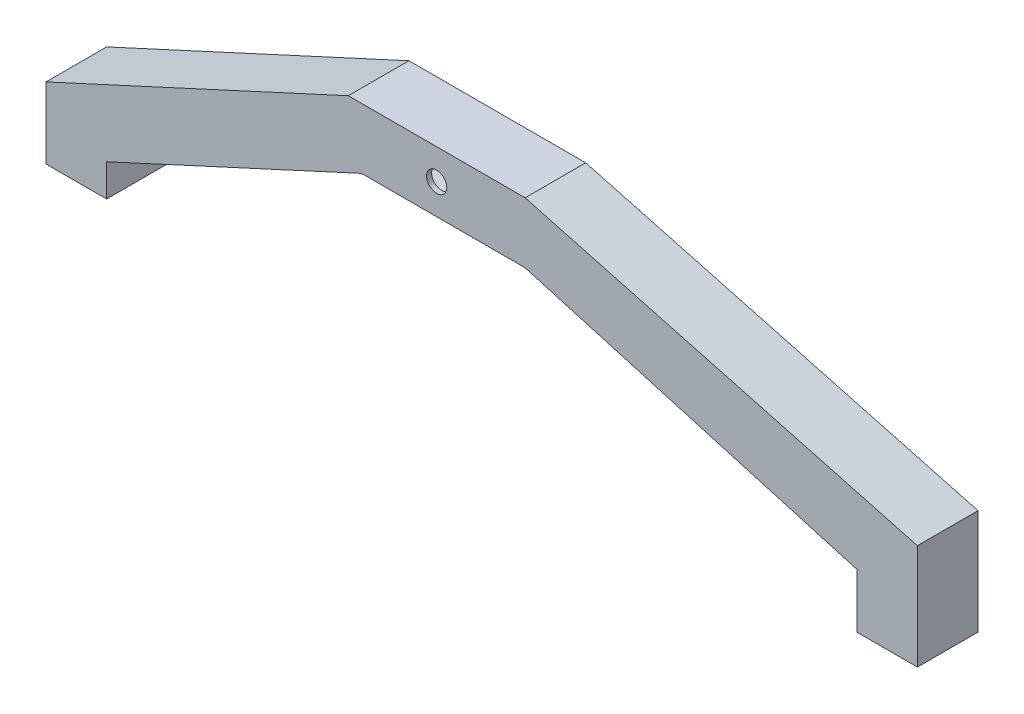
ISO-10303-21;
HEADER;
FILE_DESCRIPTION(('STEP AP214'),'2;1');
FILE_NAME('part.step','',(''),(''),'','','');
FILE_SCHEMA(('AUTOMOTIVE_DESIGN { 1 0 10303 214 1 1 1 1 }'));
ENDSEC;
DATA;
#1=APPLICATION_CONTEXT('core data for automotive mechanical design processes');
#2=APPLICATION_PROTOCOL_DEFINITION('international standard','automotive_design',2000,#1);
#3=PRODUCT_CONTEXT('',#1,'mechanical');
#4=PRODUCT('Part','Part','',(#3));
#5=PRODUCT_RELATED_PRODUCT_CATEGORY('part','',(#4));
#6=PRODUCT_DEFINITION_FORMATION('','',#4);
#7=PRODUCT_DEFINITION_CONTEXT('part definition',#1,'design');
#8=PRODUCT_DEFINITION('design','',#6,#7);
#9=PRODUCT_DEFINITION_SHAPE('','',#8);
#10=(LENGTH_UNIT() NAMED_UNIT(*) SI_UNIT(.MILLI.,.METRE.));
#11=(NAMED_UNIT(*) PLANE_ANGLE_UNIT() SI_UNIT($,.RADIAN.));
#12=(NAMED_UNIT(*) SI_UNIT($,.STERADIAN.) SOLID_ANGLE_UNIT());
#13=UNCERTAINTY_MEASURE_WITH_UNIT(LENGTH_MEASURE(1.E-05),#10,'distance_accuracy_value','');
#14=(GEOMETRIC_REPRESENTATION_CONTEXT(3) GLOBAL_UNCERTAINTY_ASSIGNED_CONTEXT((#13)) GLOBAL_UNIT_ASSIGNED_CONTEXT((#10,
#11,#12)) REPRESENTATION_CONTEXT('',''));
#15=CARTESIAN_POINT('',(0.,0.,0.));
#16=DIRECTION('',(0.,0.,1.));
#17=DIRECTION('',(1.,0.,0.));
#18=AXIS2_PLACEMENT_3D('',#15,#16,#17);
#19=CARTESIAN_POINT('',(0.,-35.63,12.));
#20=DIRECTION('',(0.,1.,0.));
#21=DIRECTION('',(0.,0.,1.));
#22=AXIS2_PLACEMENT_3D('',#19,#20,#21);
#23=PLANE('',#22);
#24=DIRECTION('',(-1.,0.,0.));
#25=VECTOR('',#24,1.);
#26=CARTESIAN_POINT('',(84.1570943734744,-35.63,11.1013641627953));
#27=LINE('',#26,#25);
#28=CARTESIAN_POINT('',(94.1570943734744,-35.63,11.1013641627953));
#29=VERTEX_POINT('',#28);
#30=CARTESIAN_POINT('',(84.1570943734744,-35.63,11.1013641627953));
#31=VERTEX_POINT('',#30);
#32=EDGE_CURVE('E446',#29,#31,#27,.T.);
#33=ORIENTED_EDGE('',*,*,#32,.F.);
#34=DIRECTION('',(0.,0.,1.));
#35=VECTOR('',#34,1.);
#36=CARTESIAN_POINT('',(94.1570943734744,-35.63,11.1013641627953));
#37=LINE('',#36,#35);
#38=CARTESIAN_POINT('',(94.1570943734744,-35.63,1.10136416279526));
#39=VERTEX_POINT('',#38);
#40=EDGE_CURVE('E60',#39,#29,#37,.T.);
#41=ORIENTED_EDGE('',*,*,#40,.F.);
#42=DIRECTION('',(1.,0.,0.));
#43=VECTOR('',#42,1.);
#44=CARTESIAN_POINT('',(84.1570943734744,-35.63,1.10136416279526));
#45=LINE('',#44,#43);
#46=CARTESIAN_POINT('',(84.1570943734744,-35.63,1.10136416279526));
#47=VERTEX_POINT('',#46);
#48=EDGE_CURVE('E324',#47,#39,#45,.T.);
#49=ORIENTED_EDGE('',*,*,#48,.F.);
#50=DIRECTION('',(0.,0.,-1.));
#51=VECTOR('',#50,1.);
#52=CARTESIAN_POINT('',(84.1570943734744,-35.63,11.1013641627953));
#53=LINE('',#52,#51);
#54=EDGE_CURVE('E449',#31,#47,#53,.T.);
#55=ORIENTED_EDGE('',*,*,#54,.F.);
#56=EDGE_LOOP('',(#33,#41,#49,#55));
#57=FACE_BOUND('',#56,.T.);
#58=DIRECTION('',(0.,0.,-1.));
#59=VECTOR('',#58,1.);
#60=CARTESIAN_POINT('',(83.1570943734744,-35.63,0.));
#61=LINE('',#60,#59);
#62=CARTESIAN_POINT('',(83.1570943734744,-35.63,12.));
#63=VERTEX_POINT('',#62);
#64=CARTESIAN_POINT('',(83.1570943734744,-35.63,0.));
#65=VERTEX_POINT('',#64);
#66=EDGE_CURVE('E234',#63,#65,#61,.T.);
#67=ORIENTED_EDGE('',*,*,#66,.T.);
#68=DIRECTION('',(1.,0.,0.));
#69=VECTOR('',#68,1.);
#70=CARTESIAN_POINT('',(0.,-35.63,0.));
#71=LINE('',#70,#69);
#72=CARTESIAN_POINT('',(95.1570943734744,-35.63,0.));
#73=VERTEX_POINT('',#72);
#74=EDGE_CURVE('E244',#65,#73,#71,.T.);
#75=ORIENTED_EDGE('',*,*,#74,.T.);
#76=DIRECTION('',(0.,0.,-1.));
#77=VECTOR('',#76,1.);
#78=CARTESIAN_POINT('',(95.1570943734744,-35.63,12.));
#79=LINE('',#78,#77);
#80=CARTESIAN_POINT('',(95.1570943734744,-35.63,12.));
#81=VERTEX_POINT('',#80);
#82=EDGE_CURVE('E304',#81,#73,#79,.T.);
#83=ORIENTED_EDGE('',*,*,#82,.F.);
#84=DIRECTION('',(1.,0.,0.));
#85=VECTOR('',#84,1.);
#86=CARTESIAN_POINT('',(0.,-35.63,12.));
#87=LINE('',#86,#85);
#88=EDGE_CURVE('E246',#63,#81,#87,.T.);
#89=ORIENTED_EDGE('',*,*,#88,.F.);
#90=EDGE_LOOP('',(#67,#75,#83,#89));
#91=FACE_BOUND('',#90,.T.);
#92=ADVANCED_FACE('F37',(#57,#91),#23,.F.);
#93=CARTESIAN_POINT('',(0.,-35.63,12.));
#94=DIRECTION('',(0.,1.,0.));
#95=DIRECTION('',(0.,0.,1.));
#96=AXIS2_PLACEMENT_3D('',#93,#94,#95);
#97=PLANE('',#96);
#98=DIRECTION('',(1.,0.,0.));
#99=VECTOR('',#98,1.);
#100=CARTESIAN_POINT('',(0.,-35.63,0.));
#101=LINE('',#100,#99);
#102=CARTESIAN_POINT('',(-77.3429056265256,-35.63,0.));
#103=VERTEX_POINT('',#102);
#104=CARTESIAN_POINT('',(-65.3429056265256,-35.63,0.));
#105=VERTEX_POINT('',#104);
#106=EDGE_CURVE('E272',#103,#105,#101,.T.);
#107=ORIENTED_EDGE('',*,*,#106,.T.);
#108=DIRECTION('',(0.,0.,-1.));
#109=VECTOR('',#108,1.);
#110=CARTESIAN_POINT('',(-65.3429056265256,-35.63,12.));
#111=LINE('',#110,#109);
#112=CARTESIAN_POINT('',(-65.3429056265256,-35.63,12.));
#113=VERTEX_POINT('',#112);
#114=EDGE_CURVE('E290',#113,#105,#111,.T.);
#115=ORIENTED_EDGE('',*,*,#114,.F.);
#116=DIRECTION('',(1.,0.,0.));
#117=VECTOR('',#116,1.);
#118=CARTESIAN_POINT('',(0.,-35.63,12.));
#119=LINE('',#118,#117);
#120=CARTESIAN_POINT('',(-77.3429056265256,-35.63,12.));
#121=VERTEX_POINT('',#120);
#122=EDGE_CURVE('E418',#121,#113,#119,.T.);
#123=ORIENTED_EDGE('',*,*,#122,.F.);
#124=DIRECTION('',(0.,0.,-1.));
#125=VECTOR('',#124,1.);
#126=CARTESIAN_POINT('',(-77.3429056265256,-35.63,12.));
#127=LINE('',#126,#125);
#128=EDGE_CURVE('E292',#121,#103,#127,.T.);
#129=ORIENTED_EDGE('',*,*,#128,.T.);
#130=EDGE_LOOP('',(#107,#115,#123,#129));
#131=FACE_BOUND('',#130,.T.);
#132=DIRECTION('',(1.,0.,0.));
#133=VECTOR('',#132,1.);
#134=CARTESIAN_POINT('',(0.,-35.63,1.));
#135=LINE('',#134,#133);
#136=CARTESIAN_POINT('',(-76.3429056265256,-35.63,1.));
#137=VERTEX_POINT('',#136);
#138=CARTESIAN_POINT('',(-66.3429056265256,-35.63,1.));
#139=VERTEX_POINT('',#138);
#140=EDGE_CURVE('E365',#137,#139,#135,.T.);
#141=ORIENTED_EDGE('',*,*,#140,.F.);
#142=DIRECTION('',(0.,0.,-1.));
#143=VECTOR('',#142,1.);
#144=CARTESIAN_POINT('',(-76.3429056265256,-35.63,12.));
#145=LINE('',#144,#143);
#146=CARTESIAN_POINT('',(-76.3429056265256,-35.63,11.));
#147=VERTEX_POINT('',#146);
#148=EDGE_CURVE('E361',#147,#137,#145,.T.);
#149=ORIENTED_EDGE('',*,*,#148,.F.);
#150=DIRECTION('',(1.,0.,0.));
#151=VECTOR('',#150,1.);
#152=CARTESIAN_POINT('',(0.,-35.63,11.));
#153=LINE('',#152,#151);
#154=CARTESIAN_POINT('',(-66.3429056265256,-35.63,11.));
#155=VERTEX_POINT('',#154);
#156=EDGE_CURVE('E368',#147,#155,#153,.T.);
#157=ORIENTED_EDGE('',*,*,#156,.T.);
#158=DIRECTION('',(0.,0.,-1.));
#159=VECTOR('',#158,1.);
#160=CARTESIAN_POINT('',(-66.3429056265256,-35.63,12.));
#161=LINE('',#160,#159);
#162=EDGE_CURVE('E385',#155,#139,#161,.T.);
#163=ORIENTED_EDGE('',*,*,#162,.T.);
#164=EDGE_LOOP('',(#141,#149,#157,#163));
#165=FACE_BOUND('',#164,.T.);
#166=ADVANCED_FACE('F499',(#131,#165),#97,.F.);
#167=CARTESIAN_POINT('',(95.1570943734744,0.,12.));
#168=DIRECTION('',(-1.,0.,0.));
#169=DIRECTION('',(0.,-1.,0.));
#170=AXIS2_PLACEMENT_3D('',#167,#168,#169);
#171=PLANE('',#170);
#172=DIRECTION('',(0.,1.,0.));
#173=VECTOR('',#172,1.);
#174=CARTESIAN_POINT('',(95.1570943734744,0.,0.));
#175=LINE('',#174,#173);
#176=CARTESIAN_POINT('',(95.1570943734744,-14.8129402340894,0.));
#177=VERTEX_POINT('',#176);
#178=EDGE_CURVE('E253',#73,#177,#175,.T.);
#179=ORIENTED_EDGE('',*,*,#178,.T.);
#180=DIRECTION('',(0.,0.,-1.));
#181=VECTOR('',#180,1.);
#182=CARTESIAN_POINT('',(95.1570943734744,-14.8129402340894,12.));
#183=LINE('',#182,#181);
#184=CARTESIAN_POINT('',(95.1570943734744,-14.8129402340894,12.));
#185=VERTEX_POINT('',#184);
#186=EDGE_CURVE('E302',#185,#177,#183,.T.);
#187=ORIENTED_EDGE('',*,*,#186,.F.);
#188=DIRECTION('',(0.,1.,0.));
#189=VECTOR('',#188,1.);
#190=CARTESIAN_POINT('',(95.1570943734744,0.,12.));
#191=LINE('',#190,#189);
#192=EDGE_CURVE('E406',#81,#185,#191,.T.);
#193=ORIENTED_EDGE('',*,*,#192,.F.);
#194=ORIENTED_EDGE('',*,*,#82,.T.);
#195=EDGE_LOOP('',(#179,#187,#193,#194));
#196=FACE_BOUND('',#195,.T.);
#197=ADVANCED_FACE('F551',(#196),#171,.F.);
#198=CARTESIAN_POINT('',(2.67307941964204,9.97377489312796,12.));
#199=DIRECTION('',(0.258874568706101,0.965910947073916,0.));
#200=DIRECTION('',(-0.965910947073917,0.258874568706101,0.));
#201=AXIS2_PLACEMENT_3D('',#198,#199,#200);
#202=PLANE('',#201);
#203=DIRECTION('',(0.965910947073917,-0.258874568706101,0.));
#204=VECTOR('',#203,1.);
#205=CARTESIAN_POINT('',(2.67307941964204,9.97377489312796,0.));
#206=LINE('',#205,#204);
#207=CARTESIAN_POINT('',(17.5,6.,0.));
#208=VERTEX_POINT('',#207);
#209=EDGE_CURVE('E256',#208,#177,#206,.T.);
#210=ORIENTED_EDGE('',*,*,#209,.F.);
#211=DIRECTION('',(0.,0.,-1.));
#212=VECTOR('',#211,1.);
#213=CARTESIAN_POINT('',(17.5,6.,12.));
#214=LINE('',#213,#212);
#215=CARTESIAN_POINT('',(17.5,6.,12.));
#216=VERTEX_POINT('',#215);
#217=EDGE_CURVE('E300',#216,#208,#214,.T.);
#218=ORIENTED_EDGE('',*,*,#217,.F.);
#219=DIRECTION('',(0.965910947073917,-0.258874568706101,0.));
#220=VECTOR('',#219,1.);
#221=CARTESIAN_POINT('',(2.67307941964204,9.97377489312796,12.));
#222=LINE('',#221,#220);
#223=EDGE_CURVE('E408',#216,#185,#222,.T.);
#224=ORIENTED_EDGE('',*,*,#223,.T.);
#225=ORIENTED_EDGE('',*,*,#186,.T.);
#226=EDGE_LOOP('',(#210,#218,#224,#225));
#227=FACE_BOUND('',#226,.T.);
#228=ADVANCED_FACE('F557',(#227),#202,.T.);
#229=CARTESIAN_POINT('',(0.,6.,12.));
#230=DIRECTION('',(0.,1.,0.));
#231=DIRECTION('',(0.,0.,1.));
#232=AXIS2_PLACEMENT_3D('',#229,#230,#231);
#233=PLANE('',#232);
#234=DIRECTION('',(1.,0.,0.));
#235=VECTOR('',#234,1.);
#236=CARTESIAN_POINT('',(0.,6.,0.));
#237=LINE('',#236,#235);
#238=CARTESIAN_POINT('',(-17.5,6.,0.));
#239=VERTEX_POINT('',#238);
#240=EDGE_CURVE('E265',#239,#208,#237,.T.);
#241=ORIENTED_EDGE('',*,*,#240,.F.);
#242=DIRECTION('',(0.,0.,-1.));
#243=VECTOR('',#242,1.);
#244=CARTESIAN_POINT('',(-17.5,6.,12.));
#245=LINE('',#244,#243);
#246=CARTESIAN_POINT('',(-17.5,6.,12.));
#247=VERTEX_POINT('',#246);
#248=EDGE_CURVE('E298',#247,#239,#245,.T.);
#249=ORIENTED_EDGE('',*,*,#248,.F.);
#250=DIRECTION('',(1.,0.,0.));
#251=VECTOR('',#250,1.);
#252=CARTESIAN_POINT('',(0.,6.,12.));
#253=LINE('',#252,#251);
#254=EDGE_CURVE('E411',#247,#216,#253,.T.);
#255=ORIENTED_EDGE('',*,*,#254,.T.);
#256=ORIENTED_EDGE('',*,*,#217,.T.);
#257=EDGE_LOOP('',(#241,#249,#255,#256));
#258=FACE_BOUND('',#257,.T.);
#259=ADVANCED_FACE('F570',(#258),#233,.T.);
#260=CARTESIAN_POINT('',(-5.33954145582519,11.598329635369,12.));
#261=DIRECTION('',(0.418184177516303,-0.90836225905473,0.));
#262=DIRECTION('',(0.90836225905473,0.418184177516303,0.));
#263=AXIS2_PLACEMENT_3D('',#260,#261,#262);
#264=PLANE('',#263);
#265=DIRECTION('',(-0.90836225905473,-0.418184177516303,0.));
#266=VECTOR('',#265,1.);
#267=CARTESIAN_POINT('',(-5.33954145582519,11.598329635369,0.));
#268=LINE('',#267,#266);
#269=CARTESIAN_POINT('',(-77.3429056265256,-21.549973614774,0.));
#270=VERTEX_POINT('',#269);
#271=EDGE_CURVE('E268',#239,#270,#268,.T.);
#272=ORIENTED_EDGE('',*,*,#271,.T.);
#273=DIRECTION('',(0.,0.,-1.));
#274=VECTOR('',#273,1.);
#275=CARTESIAN_POINT('',(-77.3429056265256,-21.549973614774,12.));
#276=LINE('',#275,#274);
#277=CARTESIAN_POINT('',(-77.3429056265256,-21.549973614774,12.));
#278=VERTEX_POINT('',#277);
#279=EDGE_CURVE('E295',#278,#270,#276,.T.);
#280=ORIENTED_EDGE('',*,*,#279,.F.);
#281=DIRECTION('',(-0.90836225905473,-0.418184177516303,0.));
#282=VECTOR('',#281,1.);
#283=CARTESIAN_POINT('',(-5.33954145582519,11.598329635369,12.));
#284=LINE('',#283,#282);
#285=EDGE_CURVE('E414',#247,#278,#284,.T.);
#286=ORIENTED_EDGE('',*,*,#285,.F.);
#287=ORIENTED_EDGE('',*,*,#248,.T.);
#288=EDGE_LOOP('',(#272,#280,#286,#287));
#289=FACE_BOUND('',#288,.T.);
#290=ADVANCED_FACE('F566',(#289),#264,.F.);
#291=CARTESIAN_POINT('',(-77.3429056265256,0.,12.));
#292=DIRECTION('',(1.,0.,0.));
#293=DIRECTION('',(0.,0.,-1.));
#294=AXIS2_PLACEMENT_3D('',#291,#292,#293);
#295=PLANE('',#294);
#296=DIRECTION('',(0.,-1.,0.));
#297=VECTOR('',#296,1.);
#298=CARTESIAN_POINT('',(-77.3429056265256,0.,0.));
#299=LINE('',#298,#297);
#300=EDGE_CURVE('E270',#270,#103,#299,.T.);
#301=ORIENTED_EDGE('',*,*,#300,.T.);
#302=ORIENTED_EDGE('',*,*,#128,.F.);
#303=DIRECTION('',(0.,-1.,0.));
#304=VECTOR('',#303,1.);
#305=CARTESIAN_POINT('',(-77.3429056265256,0.,12.));
#306=LINE('',#305,#304);
#307=EDGE_CURVE('E416',#278,#121,#306,.T.);
#308=ORIENTED_EDGE('',*,*,#307,.F.);
#309=ORIENTED_EDGE('',*,*,#279,.T.);
#310=EDGE_LOOP('',(#301,#302,#308,#309));
#311=FACE_BOUND('',#310,.T.);
#312=ADVANCED_FACE('F563',(#311),#295,.F.);
#313=CARTESIAN_POINT('',(-65.3429056265256,0.,12.));
#314=DIRECTION('',(1.,0.,0.));
#315=DIRECTION('',(0.,0.,-1.));
#316=AXIS2_PLACEMENT_3D('',#313,#314,#315);
#317=PLANE('',#316);
#318=DIRECTION('',(0.,-1.,0.));
#319=VECTOR('',#318,1.);
#320=CARTESIAN_POINT('',(-65.3429056265256,0.,0.));
#321=LINE('',#320,#319);
#322=CARTESIAN_POINT('',(-65.3429056265256,-29.2361030198748,0.));
#323=VERTEX_POINT('',#322);
#324=EDGE_CURVE('E275',#323,#105,#321,.T.);
#325=ORIENTED_EDGE('',*,*,#324,.F.);
#326=DIRECTION('',(0.,0.,-1.));
#327=VECTOR('',#326,1.);
#328=CARTESIAN_POINT('',(-65.3429056265256,-29.2361030198748,12.));
#329=LINE('',#328,#327);
#330=CARTESIAN_POINT('',(-65.3429056265256,-29.2361030198748,12.));
#331=VERTEX_POINT('',#330);
#332=EDGE_CURVE('E288',#331,#323,#329,.T.);
#333=ORIENTED_EDGE('',*,*,#332,.F.);
#334=DIRECTION('',(0.,-1.,0.));
#335=VECTOR('',#334,1.);
#336=CARTESIAN_POINT('',(-65.3429056265256,0.,12.));
#337=LINE('',#336,#335);
#338=EDGE_CURVE('E420',#331,#113,#337,.T.);
#339=ORIENTED_EDGE('',*,*,#338,.T.);
#340=ORIENTED_EDGE('',*,*,#114,.T.);
#341=EDGE_LOOP('',(#325,#333,#339,#340));
#342=FACE_BOUND('',#341,.T.);
#343=ADVANCED_FACE('F561',(#342),#317,.T.);
#344=CARTESIAN_POINT('',(-0.321331325629684,0.697982526712524,12.));
#345=DIRECTION('',(-0.418184177516307,0.908362259054728,0.));
#346=DIRECTION('',(-0.908362259054729,-0.418184177516307,0.));
#347=AXIS2_PLACEMENT_3D('',#344,#345,#346);
#348=PLANE('',#347);
#349=DIRECTION('',(0.908362259054729,0.418184177516307,0.));
#350=VECTOR('',#349,1.);
#351=CARTESIAN_POINT('',(-0.321331325629684,0.697982526712524,0.));
#352=LINE('',#351,#350);
#353=CARTESIAN_POINT('',(-14.8704100956806,-6.,0.));
#354=VERTEX_POINT('',#353);
#355=EDGE_CURVE('E278',#323,#354,#352,.T.);
#356=ORIENTED_EDGE('',*,*,#355,.T.);
#357=DIRECTION('',(0.,0.,-1.));
#358=VECTOR('',#357,1.);
#359=CARTESIAN_POINT('',(-14.8704100956806,-6.,12.));
#360=LINE('',#359,#358);
#361=CARTESIAN_POINT('',(-14.8704100956806,-6.,12.));
#362=VERTEX_POINT('',#361);
#363=EDGE_CURVE('E285',#362,#354,#360,.T.);
#364=ORIENTED_EDGE('',*,*,#363,.F.);
#365=DIRECTION('',(0.908362259054729,0.418184177516307,0.));
#366=VECTOR('',#365,1.);
#367=CARTESIAN_POINT('',(-0.321331325629684,0.697982526712524,12.));
#368=LINE('',#367,#366);
#369=EDGE_CURVE('E423',#331,#362,#368,.T.);
#370=ORIENTED_EDGE('',*,*,#369,.F.);
#371=ORIENTED_EDGE('',*,*,#332,.T.);
#372=EDGE_LOOP('',(#356,#364,#370,#371));
#373=FACE_BOUND('',#372,.T.);
#374=ADVANCED_FACE('F601',(#373),#348,.F.);
#375=CARTESIAN_POINT('',(0.,-6.,12.));
#376=DIRECTION('',(0.,1.,0.));
#377=DIRECTION('',(-1.,0.,0.));
#378=AXIS2_PLACEMENT_3D('',#375,#376,#377);
#379=PLANE('',#378);
#380=DIRECTION('',(1.,0.,0.));
#381=VECTOR('',#380,1.);
#382=CARTESIAN_POINT('',(0.,-6.,0.));
#383=LINE('',#382,#381);
#384=CARTESIAN_POINT('',(17.5,-6.,0.));
#385=VERTEX_POINT('',#384);
#386=EDGE_CURVE('E280',#354,#385,#383,.T.);
#387=ORIENTED_EDGE('',*,*,#386,.T.);
#388=DIRECTION('',(0.,0.,-1.));
#389=VECTOR('',#388,1.);
#390=CARTESIAN_POINT('',(17.5,-6.,12.));
#391=LINE('',#390,#389);
#392=CARTESIAN_POINT('',(17.5,-6.,12.));
#393=VERTEX_POINT('',#392);
#394=EDGE_CURVE('E283',#393,#385,#391,.T.);
#395=ORIENTED_EDGE('',*,*,#394,.F.);
#396=DIRECTION('',(1.,0.,0.));
#397=VECTOR('',#396,1.);
#398=CARTESIAN_POINT('',(0.,-6.,12.));
#399=LINE('',#398,#397);
#400=EDGE_CURVE('E424',#362,#393,#399,.T.);
#401=ORIENTED_EDGE('',*,*,#400,.F.);
#402=ORIENTED_EDGE('',*,*,#363,.T.);
#403=EDGE_LOOP('',(#387,#395,#401,#402));
#404=FACE_BOUND('',#403,.T.);
#405=ADVANCED_FACE('F604',(#404),#379,.F.);
#406=CARTESIAN_POINT('',(-0.259447612753441,-0.904205708316933,12.));
#407=DIRECTION('',(0.275805123433625,0.961213573503705,0.));
#408=DIRECTION('',(-0.961213573503705,0.275805123433625,0.));
#409=AXIS2_PLACEMENT_3D('',#406,#407,#408);
#410=PLANE('',#409);
#411=DIRECTION('',(0.961213573503705,-0.275805123433625,0.));
#412=VECTOR('',#411,1.);
#413=CARTESIAN_POINT('',(-0.259447612753441,-0.904205708316933,0.));
#414=LINE('',#413,#412);
#415=CARTESIAN_POINT('',(83.1570943734744,-24.839271018575,0.));
#416=VERTEX_POINT('',#415);
#417=EDGE_CURVE('E52',#385,#416,#414,.T.);
#418=ORIENTED_EDGE('',*,*,#417,.T.);
#419=DIRECTION('',(0.,0.,-1.));
#420=VECTOR('',#419,1.);
#421=CARTESIAN_POINT('',(83.1570943734744,-24.839271018575,0.));
#422=LINE('',#421,#420);
#423=CARTESIAN_POINT('',(83.1570943734744,-24.839271018575,12.));
#424=VERTEX_POINT('',#423);
#425=EDGE_CURVE('E236',#424,#416,#422,.T.);
#426=ORIENTED_EDGE('',*,*,#425,.F.);
#427=DIRECTION('',(0.961213573503705,-0.275805123433625,0.));
#428=VECTOR('',#427,1.);
#429=CARTESIAN_POINT('',(-0.259447612753441,-0.904205708316933,12.));
#430=LINE('',#429,#428);
#431=EDGE_CURVE('E261',#393,#424,#430,.T.);
#432=ORIENTED_EDGE('',*,*,#431,.F.);
#433=ORIENTED_EDGE('',*,*,#394,.T.);
#434=EDGE_LOOP('',(#418,#426,#432,#433));
#435=FACE_BOUND('',#434,.T.);
#436=ADVANCED_FACE('F431',(#435),#410,.F.);
#437=CARTESIAN_POINT('',(0.,0.,12.));
#438=DIRECTION('',(0.,0.,1.));
#439=DIRECTION('',(1.,0.,0.));
#440=AXIS2_PLACEMENT_3D('',#437,#438,#439);
#441=PLANE('',#440);
#442=ORIENTED_EDGE('',*,*,#431,.T.);
#443=DIRECTION('',(0.,-1.,0.));
#444=VECTOR('',#443,1.);
#445=CARTESIAN_POINT('',(83.1570943734744,-12.5638648482275,12.));
#446=LINE('',#445,#444);
#447=EDGE_CURVE('E239',#424,#63,#446,.T.);
#448=ORIENTED_EDGE('',*,*,#447,.T.);
#449=ORIENTED_EDGE('',*,*,#88,.T.);
#450=ORIENTED_EDGE('',*,*,#192,.T.);
#451=ORIENTED_EDGE('',*,*,#223,.F.);
#452=ORIENTED_EDGE('',*,*,#254,.F.);
#453=ORIENTED_EDGE('',*,*,#285,.T.);
#454=ORIENTED_EDGE('',*,*,#307,.T.);
#455=ORIENTED_EDGE('',*,*,#122,.T.);
#456=ORIENTED_EDGE('',*,*,#338,.F.);
#457=ORIENTED_EDGE('',*,*,#369,.T.);
#458=ORIENTED_EDGE('',*,*,#400,.T.);
#459=EDGE_LOOP('',(#442,#448,#449,#450,#451,#452,#453,#454,#455,#456,#457,#458));
#460=FACE_BOUND('',#459,.T.);
#461=CARTESIAN_POINT('',(0.,0.,12.));
#462=DIRECTION('',(0.,0.,1.));
#463=DIRECTION('',(1.,0.,0.));
#464=AXIS2_PLACEMENT_3D('',#461,#462,#463);
#465=CIRCLE('',#464,2.);
#466=CARTESIAN_POINT('',(2.00000000000001,0.,12.));
#467=VERTEX_POINT('',#466);
#468=EDGE_CURVE('E247',#467,#467,#465,.T.);
#469=ORIENTED_EDGE('',*,*,#468,.F.);
#470=EDGE_LOOP('',(#469));
#471=FACE_BOUND('',#470,.T.);
#472=ADVANCED_FACE('F429',(#460,#471),#441,.T.);
#473=CARTESIAN_POINT('',(0.,0.,0.));
#474=DIRECTION('',(0.,0.,1.));
#475=DIRECTION('',(1.,0.,0.));
#476=AXIS2_PLACEMENT_3D('',#473,#474,#475);
#477=PLANE('',#476);
#478=CARTESIAN_POINT('',(0.,0.,0.));
#479=DIRECTION('',(0.,0.,1.));
#480=DIRECTION('',(1.,0.,0.));
#481=AXIS2_PLACEMENT_3D('',#478,#479,#480);
#482=CIRCLE('',#481,2.);
#483=CARTESIAN_POINT('',(2.00000000000001,0.,0.));
#484=VERTEX_POINT('',#483);
#485=EDGE_CURVE('E435',#484,#484,#482,.T.);
#486=ORIENTED_EDGE('',*,*,#485,.T.);
#487=EDGE_LOOP('',(#486));
#488=FACE_BOUND('',#487,.T.);
#489=DIRECTION('',(0.,-1.,0.));
#490=VECTOR('',#489,1.);
#491=CARTESIAN_POINT('',(83.1570943734744,-12.5638648482275,0.));
#492=LINE('',#491,#490);
#493=EDGE_CURVE('E230',#416,#65,#492,.T.);
#494=ORIENTED_EDGE('',*,*,#493,.F.);
#495=ORIENTED_EDGE('',*,*,#417,.F.);
#496=ORIENTED_EDGE('',*,*,#386,.F.);
#497=ORIENTED_EDGE('',*,*,#355,.F.);
#498=ORIENTED_EDGE('',*,*,#324,.T.);
#499=ORIENTED_EDGE('',*,*,#106,.F.);
#500=ORIENTED_EDGE('',*,*,#300,.F.);
#501=ORIENTED_EDGE('',*,*,#271,.F.);
#502=ORIENTED_EDGE('',*,*,#240,.T.);
#503=ORIENTED_EDGE('',*,*,#209,.T.);
#504=ORIENTED_EDGE('',*,*,#178,.F.);
#505=ORIENTED_EDGE('',*,*,#74,.F.);
#506=EDGE_LOOP('',(#494,#495,#496,#497,#498,#499,#500,#501,#502,#503,#504,#505));
#507=FACE_BOUND('',#506,.T.);
#508=ADVANCED_FACE('F250',(#488,#507),#477,.F.);
#509=CARTESIAN_POINT('',(83.9390864933817,1.07330550602256E-13,12.));
#510=DIRECTION('',(-1.,0.,0.));
#511=DIRECTION('',(0.,-1.,0.));
#512=AXIS2_PLACEMENT_3D('',#509,#510,#511);
#513=PLANE('',#512);
#514=DIRECTION('',(0.,1.,0.));
#515=VECTOR('',#514,1.);
#516=CARTESIAN_POINT('',(83.9390864933817,1.07330550602256E-13,1.));
#517=LINE('',#516,#515);
#518=CARTESIAN_POINT('',(83.9390864933817,-34.63,1.));
#519=VERTEX_POINT('',#518);
#520=CARTESIAN_POINT('',(83.9390864933817,-24.0232998458148,1.));
#521=VERTEX_POINT('',#520);
#522=EDGE_CURVE('E465',#519,#521,#517,.T.);
#523=ORIENTED_EDGE('',*,*,#522,.T.);
#524=DIRECTION('',(0.,0.,-1.));
#525=VECTOR('',#524,1.);
#526=CARTESIAN_POINT('',(83.9390864933817,-24.0232998458148,12.));
#527=LINE('',#526,#525);
#528=CARTESIAN_POINT('',(83.9390864933817,-24.0232998458148,11.));
#529=VERTEX_POINT('',#528);
#530=EDGE_CURVE('E378',#529,#521,#527,.T.);
#531=ORIENTED_EDGE('',*,*,#530,.F.);
#532=DIRECTION('',(0.,1.,0.));
#533=VECTOR('',#532,1.);
#534=CARTESIAN_POINT('',(83.9390864933817,1.07330550602256E-13,11.));
#535=LINE('',#534,#533);
#536=CARTESIAN_POINT('',(83.9390864933817,-34.63,11.));
#537=VERTEX_POINT('',#536);
#538=EDGE_CURVE('E336',#537,#529,#535,.T.);
#539=ORIENTED_EDGE('',*,*,#538,.F.);
#540=DIRECTION('',(0.,0.,-1.));
#541=VECTOR('',#540,1.);
#542=CARTESIAN_POINT('',(83.9390864933817,-34.63,12.));
#543=LINE('',#542,#541);
#544=EDGE_CURVE('E254',#537,#519,#543,.T.);
#545=ORIENTED_EDGE('',*,*,#544,.T.);
#546=EDGE_LOOP('',(#523,#531,#539,#545));
#547=FACE_BOUND('',#546,.T.);
#548=ADVANCED_FACE('F521',(#547),#513,.F.);
#549=CARTESIAN_POINT('',(0.,-34.63,12.));
#550=DIRECTION('',(0.,1.,0.));
#551=DIRECTION('',(0.,0.,1.));
#552=AXIS2_PLACEMENT_3D('',#549,#550,#551);
#553=PLANE('',#552);
#554=DIRECTION('',(-1.,0.,0.));
#555=VECTOR('',#554,1.);
#556=CARTESIAN_POINT('',(0.,-34.63,1.10136416279526));
#557=LINE('',#556,#555);
#558=CARTESIAN_POINT('',(94.1570943734744,-34.63,1.10136416279526));
#559=VERTEX_POINT('',#558);
#560=CARTESIAN_POINT('',(84.1570943734744,-34.63,1.10136416279526));
#561=VERTEX_POINT('',#560);
#562=EDGE_CURVE('E463',#559,#561,#557,.T.);
#563=ORIENTED_EDGE('',*,*,#562,.F.);
#564=DIRECTION('',(0.,0.,-1.));
#565=VECTOR('',#564,1.);
#566=CARTESIAN_POINT('',(94.1570943734744,-34.63,12.));
#567=LINE('',#566,#565);
#568=CARTESIAN_POINT('',(94.1570943734744,-34.63,1.));
#569=VERTEX_POINT('',#568);
#570=EDGE_CURVE('E258',#559,#569,#567,.T.);
#571=ORIENTED_EDGE('',*,*,#570,.T.);
#572=DIRECTION('',(1.,0.,0.));
#573=VECTOR('',#572,1.);
#574=CARTESIAN_POINT('',(0.,-34.63,1.));
#575=LINE('',#574,#573);
#576=EDGE_CURVE('E467',#519,#569,#575,.T.);
#577=ORIENTED_EDGE('',*,*,#576,.F.);
#578=ORIENTED_EDGE('',*,*,#544,.F.);
#579=DIRECTION('',(1.,0.,0.));
#580=VECTOR('',#579,1.);
#581=CARTESIAN_POINT('',(0.,-34.63,11.));
#582=LINE('',#581,#580);
#583=CARTESIAN_POINT('',(84.1570943734744,-34.63,11.));
#584=VERTEX_POINT('',#583);
#585=EDGE_CURVE('E331',#537,#584,#582,.T.);
#586=ORIENTED_EDGE('',*,*,#585,.T.);
#587=DIRECTION('',(0.,0.,1.));
#588=VECTOR('',#587,1.);
#589=CARTESIAN_POINT('',(84.1570943734744,-34.63,12.));
#590=LINE('',#589,#588);
#591=EDGE_CURVE('E456',#561,#584,#590,.T.);
#592=ORIENTED_EDGE('',*,*,#591,.F.);
#593=EDGE_LOOP('',(#563,#571,#577,#578,#586,#592));
#594=FACE_BOUND('',#593,.T.);
#595=ADVANCED_FACE('F526',(#594),#553,.T.);
#596=CARTESIAN_POINT('',(94.1570943734744,0.,12.));
#597=DIRECTION('',(-1.,0.,0.));
#598=DIRECTION('',(0.,-1.,0.));
#599=AXIS2_PLACEMENT_3D('',#596,#597,#598);
#600=PLANE('',#599);
#601=ORIENTED_EDGE('',*,*,#570,.F.);
#602=DIRECTION('',(0.,-1.,0.));
#603=VECTOR('',#602,1.);
#604=CARTESIAN_POINT('',(94.1570943734744,-23.63,1.10136416279526));
#605=LINE('',#604,#603);
#606=EDGE_CURVE('E454',#559,#39,#605,.T.);
#607=ORIENTED_EDGE('',*,*,#606,.T.);
#608=ORIENTED_EDGE('',*,*,#40,.T.);
#609=DIRECTION('',(0.,-1.,0.));
#610=VECTOR('',#609,1.);
#611=CARTESIAN_POINT('',(94.1570943734744,-23.63,11.1013641627953));
#612=LINE('',#611,#610);
#613=CARTESIAN_POINT('',(94.1570943734744,-23.63,11.1013641627953));
#614=VERTEX_POINT('',#613);
#615=EDGE_CURVE('E321',#614,#29,#612,.T.);
#616=ORIENTED_EDGE('',*,*,#615,.F.);
#617=DIRECTION('',(0.,0.,1.));
#618=VECTOR('',#617,1.);
#619=CARTESIAN_POINT('',(94.1570943734744,-23.63,11.1013641627953));
#620=LINE('',#619,#618);
#621=CARTESIAN_POINT('',(94.1570943734744,-23.63,11.));
#622=VERTEX_POINT('',#621);
#623=EDGE_CURVE('E311',#622,#614,#620,.T.);
#624=ORIENTED_EDGE('',*,*,#623,.F.);
#625=DIRECTION('',(0.,1.,0.));
#626=VECTOR('',#625,1.);
#627=CARTESIAN_POINT('',(94.1570943734744,0.,11.));
#628=LINE('',#627,#626);
#629=CARTESIAN_POINT('',(94.1570943734744,-15.5802215590801,11.));
#630=VERTEX_POINT('',#629);
#631=EDGE_CURVE('E319',#622,#630,#628,.T.);
#632=ORIENTED_EDGE('',*,*,#631,.T.);
#633=DIRECTION('',(0.,0.,-1.));
#634=VECTOR('',#633,1.);
#635=CARTESIAN_POINT('',(94.1570943734744,-15.5802215590801,12.));
#636=LINE('',#635,#634);
#637=CARTESIAN_POINT('',(94.1570943734744,-15.5802215590801,1.));
#638=VERTEX_POINT('',#637);
#639=EDGE_CURVE('E340',#630,#638,#636,.T.);
#640=ORIENTED_EDGE('',*,*,#639,.T.);
#641=DIRECTION('',(0.,1.,0.));
#642=VECTOR('',#641,1.);
#643=CARTESIAN_POINT('',(94.1570943734744,0.,1.));
#644=LINE('',#643,#642);
#645=EDGE_CURVE('E346',#569,#638,#644,.T.);
#646=ORIENTED_EDGE('',*,*,#645,.F.);
#647=EDGE_LOOP('',(#601,#607,#608,#616,#624,#632,#640,#646));
#648=FACE_BOUND('',#647,.T.);
#649=ADVANCED_FACE('F318',(#648),#600,.T.);
#650=CARTESIAN_POINT('',(2.41420485093594,9.00786394605404,12.));
#651=DIRECTION('',(0.258874568706101,0.965910947073916,0.));
#652=DIRECTION('',(-0.965910947073917,0.258874568706101,0.));
#653=AXIS2_PLACEMENT_3D('',#650,#651,#652);
#654=PLANE('',#653);
#655=DIRECTION('',(0.965910947073917,-0.258874568706101,0.));
#656=VECTOR('',#655,1.);
#657=CARTESIAN_POINT('',(2.41420485093594,9.00786394605404,1.));
#658=LINE('',#657,#656);
#659=CARTESIAN_POINT('',(17.3683182627924,5.,1.));
#660=VERTEX_POINT('',#659);
#661=EDGE_CURVE('E342',#660,#638,#658,.T.);
#662=ORIENTED_EDGE('',*,*,#661,.T.);
#663=ORIENTED_EDGE('',*,*,#639,.F.);
#664=DIRECTION('',(0.965910947073917,-0.258874568706101,0.));
#665=VECTOR('',#664,1.);
#666=CARTESIAN_POINT('',(2.41420485093594,9.00786394605404,11.));
#667=LINE('',#666,#665);
#668=CARTESIAN_POINT('',(17.3683182627924,5.,11.));
#669=VERTEX_POINT('',#668);
#670=EDGE_CURVE('E330',#669,#630,#667,.T.);
#671=ORIENTED_EDGE('',*,*,#670,.F.);
#672=DIRECTION('',(0.,0.,-1.));
#673=VECTOR('',#672,1.);
#674=CARTESIAN_POINT('',(17.3683182627924,5.,12.));
#675=LINE('',#674,#673);
#676=EDGE_CURVE('E347',#669,#660,#675,.T.);
#677=ORIENTED_EDGE('',*,*,#676,.T.);
#678=EDGE_LOOP('',(#662,#663,#671,#677));
#679=FACE_BOUND('',#678,.T.);
#680=ADVANCED_FACE('F483',(#679),#654,.F.);
#681=CARTESIAN_POINT('',(0.,5.,12.));
#682=DIRECTION('',(0.,1.,0.));
#683=DIRECTION('',(0.,0.,1.));
#684=AXIS2_PLACEMENT_3D('',#681,#682,#683);
#685=PLANE('',#684);
#686=DIRECTION('',(1.,0.,0.));
#687=VECTOR('',#686,1.);
#688=CARTESIAN_POINT('',(0.,5.,1.));
#689=LINE('',#688,#687);
#690=CARTESIAN_POINT('',(-17.2808675079733,5.,1.));
#691=VERTEX_POINT('',#690);
#692=EDGE_CURVE('E345',#691,#660,#689,.T.);
#693=ORIENTED_EDGE('',*,*,#692,.T.);
#694=ORIENTED_EDGE('',*,*,#676,.F.);
#695=DIRECTION('',(1.,0.,0.));
#696=VECTOR('',#695,1.);
#697=CARTESIAN_POINT('',(0.,5.,11.));
#698=LINE('',#697,#696);
#699=CARTESIAN_POINT('',(-17.2808675079733,5.,11.));
#700=VERTEX_POINT('',#699);
#701=EDGE_CURVE('E333',#700,#669,#698,.T.);
#702=ORIENTED_EDGE('',*,*,#701,.F.);
#703=DIRECTION('',(0.,0.,-1.));
#704=VECTOR('',#703,1.);
#705=CARTESIAN_POINT('',(-17.2808675079733,5.,12.));
#706=LINE('',#705,#704);
#707=EDGE_CURVE('E348',#700,#691,#706,.T.);
#708=ORIENTED_EDGE('',*,*,#707,.T.);
#709=EDGE_LOOP('',(#693,#694,#702,#708));
#710=FACE_BOUND('',#709,.T.);
#711=ADVANCED_FACE('F486',(#710),#685,.F.);
#712=CARTESIAN_POINT('',(-4.92135727830889,10.6899673763143,12.));
#713=DIRECTION('',(0.418184177516303,-0.90836225905473,0.));
#714=DIRECTION('',(0.90836225905473,0.418184177516303,0.));
#715=AXIS2_PLACEMENT_3D('',#712,#713,#714);
#716=PLANE('',#715);
#717=DIRECTION('',(-0.90836225905473,-0.418184177516303,0.));
#718=VECTOR('',#717,1.);
#719=CARTESIAN_POINT('',(-4.92135727830889,10.6899673763143,1.));
#720=LINE('',#719,#718);
#721=CARTESIAN_POINT('',(-76.3429056265256,-22.1904843985325,1.));
#722=VERTEX_POINT('',#721);
#723=EDGE_CURVE('E352',#691,#722,#720,.T.);
#724=ORIENTED_EDGE('',*,*,#723,.F.);
#725=ORIENTED_EDGE('',*,*,#707,.F.);
#726=DIRECTION('',(-0.90836225905473,-0.418184177516303,0.));
#727=VECTOR('',#726,1.);
#728=CARTESIAN_POINT('',(-4.92135727830889,10.6899673763143,11.));
#729=LINE('',#728,#727);
#730=CARTESIAN_POINT('',(-76.3429056265256,-22.1904843985325,11.));
#731=VERTEX_POINT('',#730);
#732=EDGE_CURVE('E356',#700,#731,#729,.T.);
#733=ORIENTED_EDGE('',*,*,#732,.T.);
#734=DIRECTION('',(0.,0.,-1.));
#735=VECTOR('',#734,1.);
#736=CARTESIAN_POINT('',(-76.3429056265256,-22.1904843985325,12.));
#737=LINE('',#736,#735);
#738=EDGE_CURVE('E354',#731,#722,#737,.T.);
#739=ORIENTED_EDGE('',*,*,#738,.T.);
#740=EDGE_LOOP('',(#724,#725,#733,#739));
#741=FACE_BOUND('',#740,.T.);
#742=ADVANCED_FACE('F491',(#741),#716,.T.);
#743=CARTESIAN_POINT('',(-76.3429056265256,0.,12.));
#744=DIRECTION('',(1.,0.,0.));
#745=DIRECTION('',(0.,0.,-1.));
#746=AXIS2_PLACEMENT_3D('',#743,#744,#745);
#747=PLANE('',#746);
#748=DIRECTION('',(0.,-1.,0.));
#749=VECTOR('',#748,1.);
#750=CARTESIAN_POINT('',(-76.3429056265256,0.,1.));
#751=LINE('',#750,#749);
#752=EDGE_CURVE('E358',#722,#137,#751,.T.);
#753=ORIENTED_EDGE('',*,*,#752,.F.);
#754=ORIENTED_EDGE('',*,*,#738,.F.);
#755=DIRECTION('',(0.,-1.,0.));
#756=VECTOR('',#755,1.);
#757=CARTESIAN_POINT('',(-76.3429056265256,0.,11.));
#758=LINE('',#757,#756);
#759=EDGE_CURVE('E363',#731,#147,#758,.T.);
#760=ORIENTED_EDGE('',*,*,#759,.T.);
#761=ORIENTED_EDGE('',*,*,#148,.T.);
#762=EDGE_LOOP('',(#753,#754,#760,#761));
#763=FACE_BOUND('',#762,.T.);
#764=ADVANCED_FACE('F495',(#763),#747,.T.);
#765=CARTESIAN_POINT('',(-66.3429056265256,0.,12.));
#766=DIRECTION('',(1.,0.,0.));
#767=DIRECTION('',(0.,0.,-1.));
#768=AXIS2_PLACEMENT_3D('',#765,#766,#767);
#769=PLANE('',#768);
#770=DIRECTION('',(0.,-1.,0.));
#771=VECTOR('',#770,1.);
#772=CARTESIAN_POINT('',(-66.3429056265256,0.,1.));
#773=LINE('',#772,#771);
#774=CARTESIAN_POINT('',(-66.3429056265256,-28.5955922361164,1.));
#775=VERTEX_POINT('',#774);
#776=EDGE_CURVE('E379',#775,#139,#773,.T.);
#777=ORIENTED_EDGE('',*,*,#776,.T.);
#778=ORIENTED_EDGE('',*,*,#162,.F.);
#779=DIRECTION('',(0.,-1.,0.));
#780=VECTOR('',#779,1.);
#781=CARTESIAN_POINT('',(-66.3429056265256,0.,11.));
#782=LINE('',#781,#780);
#783=CARTESIAN_POINT('',(-66.3429056265256,-28.5955922361164,11.));
#784=VERTEX_POINT('',#783);
#785=EDGE_CURVE('E369',#784,#155,#782,.T.);
#786=ORIENTED_EDGE('',*,*,#785,.F.);
#787=DIRECTION('',(0.,0.,-1.));
#788=VECTOR('',#787,1.);
#789=CARTESIAN_POINT('',(-66.3429056265256,-28.5955922361164,12.));
#790=LINE('',#789,#788);
#791=EDGE_CURVE('E383',#784,#775,#790,.T.);
#792=ORIENTED_EDGE('',*,*,#791,.T.);
#793=EDGE_LOOP('',(#777,#778,#786,#792));
#794=FACE_BOUND('',#793,.T.);
#795=ADVANCED_FACE('F502',(#794),#769,.F.);
#796=CARTESIAN_POINT('',(-0.739515503145991,1.60634478576725,12.));
#797=DIRECTION('',(-0.418184177516307,0.908362259054728,0.));
#798=DIRECTION('',(-0.908362259054729,-0.418184177516307,0.));
#799=AXIS2_PLACEMENT_3D('',#796,#797,#798);
#800=PLANE('',#799);
#801=DIRECTION('',(0.908362259054729,0.418184177516307,0.));
#802=VECTOR('',#801,1.);
#803=CARTESIAN_POINT('',(-0.739515503145991,1.60634478576725,1.));
#804=LINE('',#803,#802);
#805=CARTESIAN_POINT('',(-15.0895425877072,-5.,1.));
#806=VERTEX_POINT('',#805);
#807=EDGE_CURVE('E382',#775,#806,#804,.T.);
#808=ORIENTED_EDGE('',*,*,#807,.F.);
#809=ORIENTED_EDGE('',*,*,#791,.F.);
#810=DIRECTION('',(0.908362259054729,0.418184177516307,0.));
#811=VECTOR('',#810,1.);
#812=CARTESIAN_POINT('',(-0.739515503145991,1.60634478576725,11.));
#813=LINE('',#812,#811);
#814=CARTESIAN_POINT('',(-15.0895425877072,-5.,11.));
#815=VERTEX_POINT('',#814);
#816=EDGE_CURVE('E372',#784,#815,#813,.T.);
#817=ORIENTED_EDGE('',*,*,#816,.T.);
#818=DIRECTION('',(0.,0.,-1.));
#819=VECTOR('',#818,1.);
#820=CARTESIAN_POINT('',(-15.0895425877072,-5.,12.));
#821=LINE('',#820,#819);
#822=EDGE_CURVE('E386',#815,#806,#821,.T.);
#823=ORIENTED_EDGE('',*,*,#822,.T.);
#824=EDGE_LOOP('',(#808,#809,#817,#823));
#825=FACE_BOUND('',#824,.T.);
#826=ADVANCED_FACE('F507',(#825),#800,.T.);
#827=CARTESIAN_POINT('',(0.,-5.,12.));
#828=DIRECTION('',(0.,1.,0.));
#829=DIRECTION('',(-1.,0.,0.));
#830=AXIS2_PLACEMENT_3D('',#827,#828,#829);
#831=PLANE('',#830);
#832=DIRECTION('',(1.,0.,0.));
#833=VECTOR('',#832,1.);
#834=CARTESIAN_POINT('',(0.,-5.,1.));
#835=LINE('',#834,#833);
#836=CARTESIAN_POINT('',(17.6406298259199,-5.,1.));
#837=VERTEX_POINT('',#836);
#838=EDGE_CURVE('E388',#806,#837,#835,.T.);
#839=ORIENTED_EDGE('',*,*,#838,.F.);
#840=ORIENTED_EDGE('',*,*,#822,.F.);
#841=DIRECTION('',(1.,0.,0.));
#842=VECTOR('',#841,1.);
#843=CARTESIAN_POINT('',(0.,-5.,11.));
#844=LINE('',#843,#842);
#845=CARTESIAN_POINT('',(17.6406298259199,-5.,11.));
#846=VERTEX_POINT('',#845);
#847=EDGE_CURVE('E374',#815,#846,#844,.T.);
#848=ORIENTED_EDGE('',*,*,#847,.T.);
#849=DIRECTION('',(0.,0.,-1.));
#850=VECTOR('',#849,1.);
#851=CARTESIAN_POINT('',(17.6406298259199,-5.,12.));
#852=LINE('',#851,#850);
#853=EDGE_CURVE('E391',#846,#837,#852,.T.);
#854=ORIENTED_EDGE('',*,*,#853,.T.);
#855=EDGE_LOOP('',(#839,#840,#848,#854));
#856=FACE_BOUND('',#855,.T.);
#857=ADVANCED_FACE('F513',(#856),#831,.T.);
#858=CARTESIAN_POINT('',(0.0163575106801844,0.0570078651867719,12.));
#859=DIRECTION('',(0.275805123433625,0.961213573503705,0.));
#860=DIRECTION('',(-0.961213573503705,0.275805123433625,0.));
#861=AXIS2_PLACEMENT_3D('',#858,#859,#860);
#862=PLANE('',#861);
#863=DIRECTION('',(0.961213573503705,-0.275805123433625,0.));
#864=VECTOR('',#863,1.);
#865=CARTESIAN_POINT('',(0.0163575106801844,0.0570078651867719,1.));
#866=LINE('',#865,#864);
#867=EDGE_CURVE('E393',#837,#521,#866,.T.);
#868=ORIENTED_EDGE('',*,*,#867,.F.);
#869=ORIENTED_EDGE('',*,*,#853,.F.);
#870=DIRECTION('',(0.961213573503705,-0.275805123433625,0.));
#871=VECTOR('',#870,1.);
#872=CARTESIAN_POINT('',(0.0163575106801844,0.0570078651867719,11.));
#873=LINE('',#872,#871);
#874=EDGE_CURVE('E376',#846,#529,#873,.T.);
#875=ORIENTED_EDGE('',*,*,#874,.T.);
#876=ORIENTED_EDGE('',*,*,#530,.T.);
#877=EDGE_LOOP('',(#868,#869,#875,#876));
#878=FACE_BOUND('',#877,.T.);
#879=ADVANCED_FACE('F517',(#878),#862,.T.);
#880=CARTESIAN_POINT('',(0.,0.,11.));
#881=DIRECTION('',(0.,0.,1.));
#882=DIRECTION('',(1.,0.,0.));
#883=AXIS2_PLACEMENT_3D('',#880,#881,#882);
#884=PLANE('',#883);
#885=CARTESIAN_POINT('',(0.,0.,11.));
#886=DIRECTION('',(0.,0.,1.));
#887=DIRECTION('',(1.,0.,0.));
#888=AXIS2_PLACEMENT_3D('',#885,#886,#887);
#889=CIRCLE('',#888,2.);
#890=CARTESIAN_POINT('',(2.00000000000001,0.,11.));
#891=VERTEX_POINT('',#890);
#892=EDGE_CURVE('E440',#891,#891,#889,.T.);
#893=ORIENTED_EDGE('',*,*,#892,.T.);
#894=EDGE_LOOP('',(#893));
#895=FACE_BOUND('',#894,.T.);
#896=DIRECTION('',(1.,0.,0.));
#897=VECTOR('',#896,1.);
#898=CARTESIAN_POINT('',(0.,-23.63,11.));
#899=LINE('',#898,#897);
#900=CARTESIAN_POINT('',(84.1570943734744,-23.63,11.));
#901=VERTEX_POINT('',#900);
#902=EDGE_CURVE('E45',#901,#622,#899,.T.);
#903=ORIENTED_EDGE('',*,*,#902,.F.);
#904=DIRECTION('',(0.,-1.,0.));
#905=VECTOR('',#904,1.);
#906=CARTESIAN_POINT('',(84.1570943734744,0.,11.));
#907=LINE('',#906,#905);
#908=EDGE_CURVE('E11',#901,#584,#907,.T.);
#909=ORIENTED_EDGE('',*,*,#908,.T.);
#910=ORIENTED_EDGE('',*,*,#585,.F.);
#911=ORIENTED_EDGE('',*,*,#538,.T.);
#912=ORIENTED_EDGE('',*,*,#874,.F.);
#913=ORIENTED_EDGE('',*,*,#847,.F.);
#914=ORIENTED_EDGE('',*,*,#816,.F.);
#915=ORIENTED_EDGE('',*,*,#785,.T.);
#916=ORIENTED_EDGE('',*,*,#156,.F.);
#917=ORIENTED_EDGE('',*,*,#759,.F.);
#918=ORIENTED_EDGE('',*,*,#732,.F.);
#919=ORIENTED_EDGE('',*,*,#701,.T.);
#920=ORIENTED_EDGE('',*,*,#670,.T.);
#921=ORIENTED_EDGE('',*,*,#631,.F.);
#922=EDGE_LOOP('',(#903,#909,#910,#911,#912,#913,#914,#915,#916,#917,#918,#919,#920,#921));
#923=FACE_BOUND('',#922,.T.);
#924=ADVANCED_FACE('F327',(#895,#923),#884,.F.);
#925=CARTESIAN_POINT('',(0.,0.,1.));
#926=DIRECTION('',(0.,0.,1.));
#927=DIRECTION('',(1.,0.,0.));
#928=AXIS2_PLACEMENT_3D('',#925,#926,#927);
#929=PLANE('',#928);
#930=CARTESIAN_POINT('',(0.,0.,1.));
#931=DIRECTION('',(0.,0.,1.));
#932=DIRECTION('',(1.,0.,0.));
#933=AXIS2_PLACEMENT_3D('',#930,#931,#932);
#934=CIRCLE('',#933,2.);
#935=CARTESIAN_POINT('',(2.00000000000001,0.,1.));
#936=VERTEX_POINT('',#935);
#937=EDGE_CURVE('E40',#936,#936,#934,.T.);
#938=ORIENTED_EDGE('',*,*,#937,.F.);
#939=EDGE_LOOP('',(#938));
#940=FACE_BOUND('',#939,.T.);
#941=ORIENTED_EDGE('',*,*,#522,.F.);
#942=ORIENTED_EDGE('',*,*,#576,.T.);
#943=ORIENTED_EDGE('',*,*,#645,.T.);
#944=ORIENTED_EDGE('',*,*,#661,.F.);
#945=ORIENTED_EDGE('',*,*,#692,.F.);
#946=ORIENTED_EDGE('',*,*,#723,.T.);
#947=ORIENTED_EDGE('',*,*,#752,.T.);
#948=ORIENTED_EDGE('',*,*,#140,.T.);
#949=ORIENTED_EDGE('',*,*,#776,.F.);
#950=ORIENTED_EDGE('',*,*,#807,.T.);
#951=ORIENTED_EDGE('',*,*,#838,.T.);
#952=ORIENTED_EDGE('',*,*,#867,.T.);
#953=EDGE_LOOP('',(#941,#942,#943,#944,#945,#946,#947,#948,#949,#950,#951,#952));
#954=FACE_BOUND('',#953,.T.);
#955=ADVANCED_FACE('F479',(#940,#954),#929,.T.);
#956=CARTESIAN_POINT('',(0.,-23.63,0.));
#957=DIRECTION('',(0.,-1.,0.));
#958=DIRECTION('',(0.,0.,-1.));
#959=AXIS2_PLACEMENT_3D('',#956,#957,#958);
#960=PLANE('',#959);
#961=ORIENTED_EDGE('',*,*,#902,.T.);
#962=ORIENTED_EDGE('',*,*,#623,.T.);
#963=DIRECTION('',(-1.,0.,0.));
#964=VECTOR('',#963,1.);
#965=CARTESIAN_POINT('',(84.1570943734744,-23.63,11.1013641627953));
#966=LINE('',#965,#964);
#967=CARTESIAN_POINT('',(84.1570943734744,-23.63,11.1013641627953));
#968=VERTEX_POINT('',#967);
#969=EDGE_CURVE('E323',#614,#968,#966,.T.);
#970=ORIENTED_EDGE('',*,*,#969,.T.);
#971=DIRECTION('',(0.,0.,-1.));
#972=VECTOR('',#971,1.);
#973=CARTESIAN_POINT('',(84.1570943734744,-23.63,11.1013641627953));
#974=LINE('',#973,#972);
#975=EDGE_CURVE('E313',#968,#901,#974,.T.);
#976=ORIENTED_EDGE('',*,*,#975,.T.);
#977=EDGE_LOOP('',(#961,#962,#970,#976));
#978=FACE_BOUND('',#977,.T.);
#979=ADVANCED_FACE('F309',(#978),#960,.T.);
#980=CARTESIAN_POINT('',(84.1570943734744,-23.63,1.10136416279526));
#981=DIRECTION('',(0.,0.,-1.));
#982=DIRECTION('',(-1.,0.,0.));
#983=AXIS2_PLACEMENT_3D('',#980,#981,#982);
#984=PLANE('',#983);
#985=ORIENTED_EDGE('',*,*,#562,.T.);
#986=DIRECTION('',(0.,-1.,0.));
#987=VECTOR('',#986,1.);
#988=CARTESIAN_POINT('',(84.1570943734744,-23.63,1.10136416279526));
#989=LINE('',#988,#987);
#990=EDGE_CURVE('E457',#561,#47,#989,.T.);
#991=ORIENTED_EDGE('',*,*,#990,.T.);
#992=ORIENTED_EDGE('',*,*,#48,.T.);
#993=ORIENTED_EDGE('',*,*,#606,.F.);
#994=EDGE_LOOP('',(#985,#991,#992,#993));
#995=FACE_BOUND('',#994,.T.);
#996=ADVANCED_FACE('F529',(#995),#984,.F.);
#997=CARTESIAN_POINT('',(84.1570943734744,-23.63,11.1013641627953));
#998=DIRECTION('',(-1.,0.,0.));
#999=DIRECTION('',(0.,0.,1.));
#1000=AXIS2_PLACEMENT_3D('',#997,#998,#999);
#1001=PLANE('',#1000);
#1002=ORIENTED_EDGE('',*,*,#591,.T.);
#1003=ORIENTED_EDGE('',*,*,#908,.F.);
#1004=ORIENTED_EDGE('',*,*,#975,.F.);
#1005=DIRECTION('',(0.,-1.,0.));
#1006=VECTOR('',#1005,1.);
#1007=CARTESIAN_POINT('',(84.1570943734744,-23.63,11.1013641627953));
#1008=LINE('',#1007,#1006);
#1009=EDGE_CURVE('E459',#968,#31,#1008,.T.);
#1010=ORIENTED_EDGE('',*,*,#1009,.T.);
#1011=ORIENTED_EDGE('',*,*,#54,.T.);
#1012=ORIENTED_EDGE('',*,*,#990,.F.);
#1013=EDGE_LOOP('',(#1002,#1003,#1004,#1010,#1011,#1012));
#1014=FACE_BOUND('',#1013,.T.);
#1015=ADVANCED_FACE('F537',(#1014),#1001,.F.);
#1016=CARTESIAN_POINT('',(84.1570943734744,-23.63,11.1013641627953));
#1017=DIRECTION('',(0.,0.,1.));
#1018=DIRECTION('',(1.,0.,0.));
#1019=AXIS2_PLACEMENT_3D('',#1016,#1017,#1018);
#1020=PLANE('',#1019);
#1021=ORIENTED_EDGE('',*,*,#32,.T.);
#1022=ORIENTED_EDGE('',*,*,#1009,.F.);
#1023=ORIENTED_EDGE('',*,*,#969,.F.);
#1024=ORIENTED_EDGE('',*,*,#615,.T.);
#1025=EDGE_LOOP('',(#1021,#1022,#1023,#1024));
#1026=FACE_BOUND('',#1025,.T.);
#1027=ADVANCED_FACE('F535',(#1026),#1020,.F.);
#1028=CARTESIAN_POINT('',(0.,0.,0.));
#1029=DIRECTION('',(0.,0.,1.));
#1030=DIRECTION('',(1.,0.,0.));
#1031=AXIS2_PLACEMENT_3D('',#1028,#1029,#1030);
#1032=CYLINDRICAL_SURFACE('',#1031,2.);
#1033=ORIENTED_EDGE('',*,*,#937,.T.);
#1034=EDGE_LOOP('',(#1033));
#1035=FACE_BOUND('',#1034,.T.);
#1036=ORIENTED_EDGE('',*,*,#485,.F.);
#1037=EDGE_LOOP('',(#1036));
#1038=FACE_BOUND('',#1037,.T.);
#1039=ADVANCED_FACE('F544',(#1035,#1038),#1032,.F.);
#1040=ORIENTED_EDGE('',*,*,#468,.T.);
#1041=EDGE_LOOP('',(#1040));
#1042=FACE_BOUND('',#1041,.T.);
#1043=ORIENTED_EDGE('',*,*,#892,.F.);
#1044=EDGE_LOOP('',(#1043));
#1045=FACE_BOUND('',#1044,.T.);
#1046=ADVANCED_FACE('F726',(#1042,#1045),#1032,.F.);
#1047=CARTESIAN_POINT('',(83.1570943734744,-12.5638648482275,0.));
#1048=DIRECTION('',(-1.,0.,0.));
#1049=DIRECTION('',(0.,0.,1.));
#1050=AXIS2_PLACEMENT_3D('',#1047,#1048,#1049);
#1051=PLANE('',#1050);
#1052=ORIENTED_EDGE('',*,*,#425,.T.);
#1053=ORIENTED_EDGE('',*,*,#493,.T.);
#1054=ORIENTED_EDGE('',*,*,#66,.F.);
#1055=ORIENTED_EDGE('',*,*,#447,.F.);
#1056=EDGE_LOOP('',(#1052,#1053,#1054,#1055));
#1057=FACE_BOUND('',#1056,.T.);
#1058=ADVANCED_FACE('F232',(#1057),#1051,.T.);
#1059=CLOSED_SHELL('',(#92,#166,#197,#228,#259,#290,#312,#343,#374,#405,#436,#472,#508,#548,
#595,#649,#680,#711,#742,#764,#795,#826,#857,#879,#924,#955,#979,#996,#1015,#1027,#1039,#1046,#1058));
#1060=MANIFOLD_SOLID_BREP('B2',#1059);
#1061=ADVANCED_BREP_SHAPE_REPRESENTATION('',(#18,#1060),#14);
#1062=SHAPE_DEFINITION_REPRESENTATION(#9,#1061);
ENDSEC;
END-ISO-10303-21;
